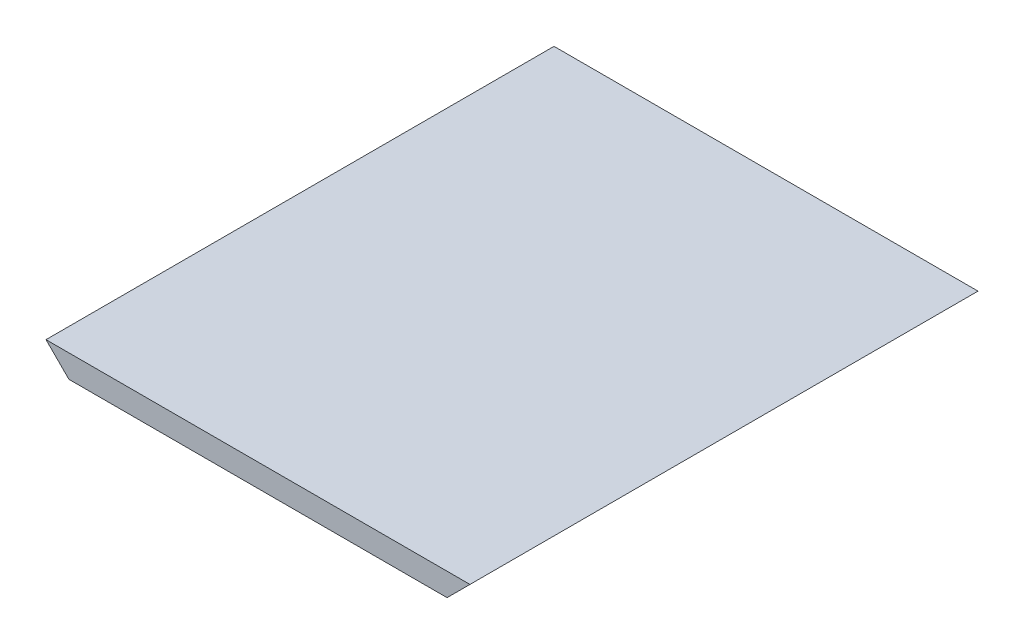
ISO-10303-21;
HEADER;
FILE_DESCRIPTION(('STEP AP214'),'2;1');
FILE_NAME('part.step','',(''),(''),'','','');
FILE_SCHEMA(('AUTOMOTIVE_DESIGN { 1 0 10303 214 1 1 1 1 }'));
ENDSEC;
DATA;
#1=APPLICATION_CONTEXT('core data for automotive mechanical design processes');
#2=APPLICATION_PROTOCOL_DEFINITION('international standard','automotive_design',2000,#1);
#3=PRODUCT_CONTEXT('',#1,'mechanical');
#4=PRODUCT('Part','Part','',(#3));
#5=PRODUCT_RELATED_PRODUCT_CATEGORY('part','',(#4));
#6=PRODUCT_DEFINITION_FORMATION('','',#4);
#7=PRODUCT_DEFINITION_CONTEXT('part definition',#1,'design');
#8=PRODUCT_DEFINITION('design','',#6,#7);
#9=PRODUCT_DEFINITION_SHAPE('','',#8);
#10=(LENGTH_UNIT() NAMED_UNIT(*) SI_UNIT(.MILLI.,.METRE.));
#11=(NAMED_UNIT(*) PLANE_ANGLE_UNIT() SI_UNIT($,.RADIAN.));
#12=(NAMED_UNIT(*) SI_UNIT($,.STERADIAN.) SOLID_ANGLE_UNIT());
#13=UNCERTAINTY_MEASURE_WITH_UNIT(LENGTH_MEASURE(1.E-05),#10,'distance_accuracy_value','');
#14=(GEOMETRIC_REPRESENTATION_CONTEXT(3) GLOBAL_UNCERTAINTY_ASSIGNED_CONTEXT((#13)) GLOBAL_UNIT_ASSIGNED_CONTEXT((#10,
#11,#12)) REPRESENTATION_CONTEXT('',''));
#15=CARTESIAN_POINT('',(0.,0.,0.));
#16=DIRECTION('',(0.,0.,1.));
#17=DIRECTION('',(1.,0.,0.));
#18=AXIS2_PLACEMENT_3D('',#15,#16,#17);
#19=CARTESIAN_POINT('',(-55.5,6.,66.5));
#20=DIRECTION('',(0.,0.,-1.));
#21=DIRECTION('',(-1.,0.,0.));
#22=AXIS2_PLACEMENT_3D('',#19,#20,#21);
#23=PLANE('',#22);
#24=DIRECTION('',(1.,0.,0.));
#25=VECTOR('',#24,1.);
#26=CARTESIAN_POINT('',(-55.5,6.,66.5));
#27=LINE('',#26,#25);
#28=CARTESIAN_POINT('',(-55.5,6.,66.5));
#29=VERTEX_POINT('',#28);
#30=CARTESIAN_POINT('',(55.5,6.,66.5));
#31=VERTEX_POINT('',#30);
#32=EDGE_CURVE('E83',#29,#31,#27,.T.);
#33=ORIENTED_EDGE('',*,*,#32,.F.);
#34=DIRECTION('',(0.707106781186548,-0.707106781186547,0.));
#35=VECTOR('',#34,1.);
#36=CARTESIAN_POINT('',(-49.5,0.,66.5));
#37=LINE('',#36,#35);
#38=CARTESIAN_POINT('',(-49.5,0.,66.5));
#39=VERTEX_POINT('',#38);
#40=EDGE_CURVE('E11',#29,#39,#37,.T.);
#41=ORIENTED_EDGE('',*,*,#40,.T.);
#42=DIRECTION('',(1.,0.,0.));
#43=VECTOR('',#42,1.);
#44=CARTESIAN_POINT('',(-55.5,0.,66.5));
#45=LINE('',#44,#43);
#46=CARTESIAN_POINT('',(49.5,0.,66.5));
#47=VERTEX_POINT('',#46);
#48=EDGE_CURVE('E86',#39,#47,#45,.T.);
#49=ORIENTED_EDGE('',*,*,#48,.T.);
#50=DIRECTION('',(-0.707106781186549,-0.707106781186546,0.));
#51=VECTOR('',#50,1.);
#52=CARTESIAN_POINT('',(55.5,6.,66.5));
#53=LINE('',#52,#51);
#54=EDGE_CURVE('E48',#47,#31,#53,.F.);
#55=ORIENTED_EDGE('',*,*,#54,.T.);
#56=EDGE_LOOP('',(#33,#41,#49,#55));
#57=FACE_BOUND('',#56,.T.);
#58=ADVANCED_FACE('F39',(#57),#23,.F.);
#59=CARTESIAN_POINT('',(-55.5,6.,-66.5));
#60=DIRECTION('',(0.,0.,-1.));
#61=DIRECTION('',(-1.,0.,0.));
#62=AXIS2_PLACEMENT_3D('',#59,#60,#61);
#63=PLANE('',#62);
#64=DIRECTION('',(1.,0.,0.));
#65=VECTOR('',#64,1.);
#66=CARTESIAN_POINT('',(-55.5,0.,-66.5));
#67=LINE('',#66,#65);
#68=CARTESIAN_POINT('',(-49.5,0.,-66.5));
#69=VERTEX_POINT('',#68);
#70=CARTESIAN_POINT('',(49.5,0.,-66.5));
#71=VERTEX_POINT('',#70);
#72=EDGE_CURVE('E99',#69,#71,#67,.T.);
#73=ORIENTED_EDGE('',*,*,#72,.F.);
#74=DIRECTION('',(-0.707106781186548,0.707106781186547,0.));
#75=VECTOR('',#74,1.);
#76=CARTESIAN_POINT('',(-55.5,6.,-66.5));
#77=LINE('',#76,#75);
#78=CARTESIAN_POINT('',(-55.5,6.,-66.5));
#79=VERTEX_POINT('',#78);
#80=EDGE_CURVE('E63',#69,#79,#77,.T.);
#81=ORIENTED_EDGE('',*,*,#80,.T.);
#82=DIRECTION('',(1.,0.,0.));
#83=VECTOR('',#82,1.);
#84=CARTESIAN_POINT('',(-55.5,6.,-66.5));
#85=LINE('',#84,#83);
#86=CARTESIAN_POINT('',(55.5,6.,-66.5));
#87=VERTEX_POINT('',#86);
#88=EDGE_CURVE('E102',#79,#87,#85,.T.);
#89=ORIENTED_EDGE('',*,*,#88,.T.);
#90=DIRECTION('',(0.707106781186549,0.707106781186546,0.));
#91=VECTOR('',#90,1.);
#92=CARTESIAN_POINT('',(-2.98372437868011E-13,-49.5,-66.5));
#93=LINE('',#92,#91);
#94=EDGE_CURVE('E55',#87,#71,#93,.F.);
#95=ORIENTED_EDGE('',*,*,#94,.T.);
#96=EDGE_LOOP('',(#73,#81,#89,#95));
#97=FACE_BOUND('',#96,.T.);
#98=ADVANCED_FACE('F122',(#97),#63,.T.);
#99=CARTESIAN_POINT('',(0.,6.,0.));
#100=DIRECTION('',(0.,1.,0.));
#101=DIRECTION('',(0.,0.,1.));
#102=AXIS2_PLACEMENT_3D('',#99,#100,#101);
#103=PLANE('',#102);
#104=ORIENTED_EDGE('',*,*,#32,.T.);
#105=DIRECTION('',(0.,0.,-1.));
#106=VECTOR('',#105,1.);
#107=CARTESIAN_POINT('',(55.5,6.,66.5));
#108=LINE('',#107,#106);
#109=EDGE_CURVE('E95',#31,#87,#108,.T.);
#110=ORIENTED_EDGE('',*,*,#109,.T.);
#111=ORIENTED_EDGE('',*,*,#88,.F.);
#112=DIRECTION('',(0.,0.,-1.));
#113=VECTOR('',#112,1.);
#114=CARTESIAN_POINT('',(-55.5,6.,66.5));
#115=LINE('',#114,#113);
#116=EDGE_CURVE('E96',#29,#79,#115,.T.);
#117=ORIENTED_EDGE('',*,*,#116,.F.);
#118=EDGE_LOOP('',(#104,#110,#111,#117));
#119=FACE_BOUND('',#118,.T.);
#120=ADVANCED_FACE('F93',(#119),#103,.T.);
#121=CARTESIAN_POINT('',(0.,0.,0.));
#122=DIRECTION('',(0.,1.,0.));
#123=DIRECTION('',(0.,0.,1.));
#124=AXIS2_PLACEMENT_3D('',#121,#122,#123);
#125=PLANE('',#124);
#126=ORIENTED_EDGE('',*,*,#48,.F.);
#127=DIRECTION('',(0.,0.,-1.));
#128=VECTOR('',#127,1.);
#129=CARTESIAN_POINT('',(-49.5,0.,-66.5));
#130=LINE('',#129,#128);
#131=EDGE_CURVE('E116',#39,#69,#130,.T.);
#132=ORIENTED_EDGE('',*,*,#131,.T.);
#133=ORIENTED_EDGE('',*,*,#72,.T.);
#134=DIRECTION('',(0.,0.,1.));
#135=VECTOR('',#134,1.);
#136=CARTESIAN_POINT('',(49.5,0.,0.));
#137=LINE('',#136,#135);
#138=EDGE_CURVE('E109',#71,#47,#137,.T.);
#139=ORIENTED_EDGE('',*,*,#138,.T.);
#140=EDGE_LOOP('',(#126,#132,#133,#139));
#141=FACE_BOUND('',#140,.T.);
#142=ADVANCED_FACE('F125',(#141),#125,.F.);
#143=CARTESIAN_POINT('',(-49.5,0.,0.));
#144=DIRECTION('',(-0.707106781186547,-0.707106781186548,0.));
#145=DIRECTION('',(0.,0.,1.));
#146=AXIS2_PLACEMENT_3D('',#143,#144,#145);
#147=PLANE('',#146);
#148=ORIENTED_EDGE('',*,*,#40,.F.);
#149=ORIENTED_EDGE('',*,*,#116,.T.);
#150=ORIENTED_EDGE('',*,*,#80,.F.);
#151=ORIENTED_EDGE('',*,*,#131,.F.);
#152=EDGE_LOOP('',(#148,#149,#150,#151));
#153=FACE_BOUND('',#152,.T.);
#154=ADVANCED_FACE('F123',(#153),#147,.T.);
#155=CARTESIAN_POINT('',(55.5,6.,66.5));
#156=DIRECTION('',(-0.707106781186546,0.707106781186549,0.));
#157=DIRECTION('',(0.,0.,-1.));
#158=AXIS2_PLACEMENT_3D('',#155,#156,#157);
#159=PLANE('',#158);
#160=ORIENTED_EDGE('',*,*,#54,.F.);
#161=ORIENTED_EDGE('',*,*,#138,.F.);
#162=ORIENTED_EDGE('',*,*,#94,.F.);
#163=ORIENTED_EDGE('',*,*,#109,.F.);
#164=EDGE_LOOP('',(#160,#161,#162,#163));
#165=FACE_BOUND('',#164,.T.);
#166=ADVANCED_FACE('F41',(#165),#159,.F.);
#167=CLOSED_SHELL('',(#58,#98,#120,#142,#154,#166));
#168=MANIFOLD_SOLID_BREP('B2',#167);
#169=ADVANCED_BREP_SHAPE_REPRESENTATION('',(#18,#168),#14);
#170=SHAPE_DEFINITION_REPRESENTATION(#9,#169);
ENDSEC;
END-ISO-10303-21;
